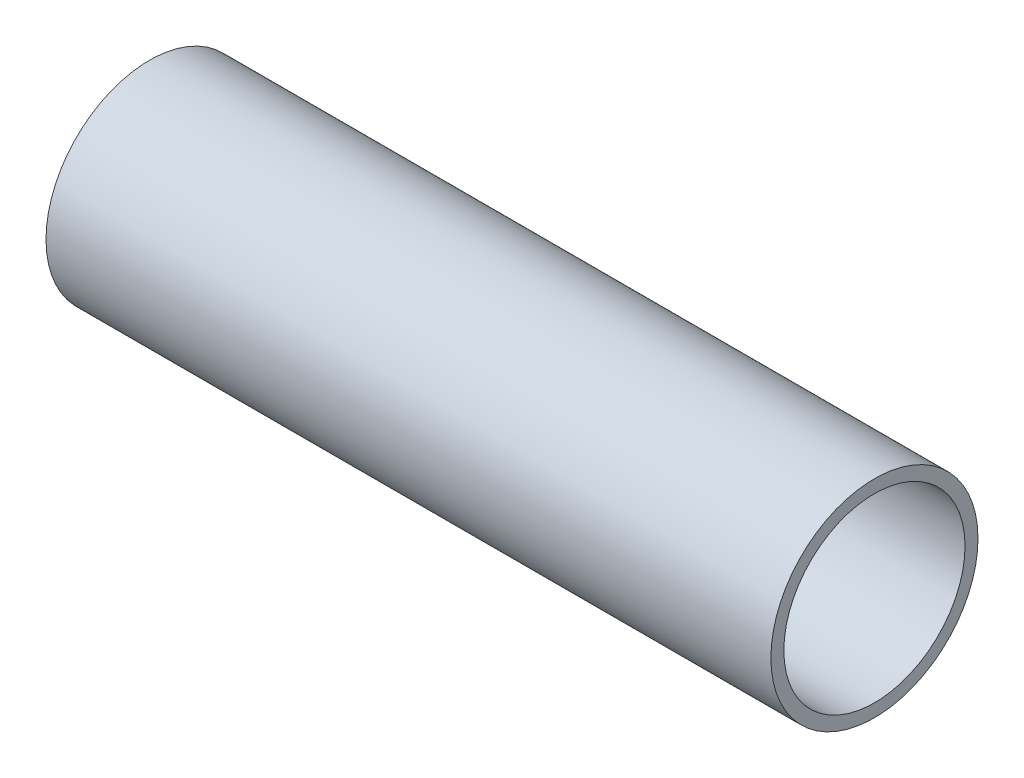
ISO-10303-21;
HEADER;
FILE_DESCRIPTION(('STEP AP214'),'2;1');
FILE_NAME('part.step','',(''),(''),'','','');
FILE_SCHEMA(('AUTOMOTIVE_DESIGN { 1 0 10303 214 1 1 1 1 }'));
ENDSEC;
DATA;
#1=APPLICATION_CONTEXT('core data for automotive mechanical design processes');
#2=APPLICATION_PROTOCOL_DEFINITION('international standard','automotive_design',2000,#1);
#3=PRODUCT_CONTEXT('',#1,'mechanical');
#4=PRODUCT('Part','Part','',(#3));
#5=PRODUCT_RELATED_PRODUCT_CATEGORY('part','',(#4));
#6=PRODUCT_DEFINITION_FORMATION('','',#4);
#7=PRODUCT_DEFINITION_CONTEXT('part definition',#1,'design');
#8=PRODUCT_DEFINITION('design','',#6,#7);
#9=PRODUCT_DEFINITION_SHAPE('','',#8);
#10=(LENGTH_UNIT() NAMED_UNIT(*) SI_UNIT(.MILLI.,.METRE.));
#11=(NAMED_UNIT(*) PLANE_ANGLE_UNIT() SI_UNIT($,.RADIAN.));
#12=(NAMED_UNIT(*) SI_UNIT($,.STERADIAN.) SOLID_ANGLE_UNIT());
#13=UNCERTAINTY_MEASURE_WITH_UNIT(LENGTH_MEASURE(1.E-05),#10,'distance_accuracy_value','');
#14=(GEOMETRIC_REPRESENTATION_CONTEXT(3) GLOBAL_UNCERTAINTY_ASSIGNED_CONTEXT((#13)) GLOBAL_UNIT_ASSIGNED_CONTEXT((#10,
#11,#12)) REPRESENTATION_CONTEXT('',''));
#15=CARTESIAN_POINT('',(0.,0.,0.));
#16=DIRECTION('',(0.,0.,1.));
#17=DIRECTION('',(1.,0.,0.));
#18=AXIS2_PLACEMENT_3D('',#15,#16,#17);
#19=CARTESIAN_POINT('',(177.8,0.,0.));
#20=DIRECTION('',(1.,0.,0.));
#21=DIRECTION('',(0.,0.,-1.));
#22=AXIS2_PLACEMENT_3D('',#19,#20,#21);
#23=PLANE('',#22);
#24=CARTESIAN_POINT('',(177.8,0.,0.));
#25=DIRECTION('',(1.,0.,0.));
#26=DIRECTION('',(0.,0.,-1.));
#27=AXIS2_PLACEMENT_3D('',#24,#25,#26);
#28=CIRCLE('',#27,25.4);
#29=CARTESIAN_POINT('',(177.8,0.,-25.4));
#30=VERTEX_POINT('',#29);
#31=EDGE_CURVE('E10',#30,#30,#28,.T.);
#32=ORIENTED_EDGE('',*,*,#31,.T.);
#33=EDGE_LOOP('',(#32));
#34=FACE_BOUND('',#33,.T.);
#35=CARTESIAN_POINT('',(177.8,0.,0.));
#36=DIRECTION('',(1.,0.,0.));
#37=DIRECTION('',(0.,0.,-1.));
#38=AXIS2_PLACEMENT_3D('',#35,#36,#37);
#39=CIRCLE('',#38,22.225);
#40=CARTESIAN_POINT('',(177.8,0.,-22.225));
#41=VERTEX_POINT('',#40);
#42=EDGE_CURVE('E45',#41,#41,#39,.T.);
#43=ORIENTED_EDGE('',*,*,#42,.F.);
#44=EDGE_LOOP('',(#43));
#45=FACE_BOUND('',#44,.T.);
#46=ADVANCED_FACE('F34',(#34,#45),#23,.T.);
#47=CARTESIAN_POINT('',(0.,0.,0.));
#48=DIRECTION('',(1.,0.,0.));
#49=DIRECTION('',(0.,0.,-1.));
#50=AXIS2_PLACEMENT_3D('',#47,#48,#49);
#51=PLANE('',#50);
#52=CARTESIAN_POINT('',(0.,0.,0.));
#53=DIRECTION('',(1.,0.,0.));
#54=DIRECTION('',(0.,0.,-1.));
#55=AXIS2_PLACEMENT_3D('',#52,#53,#54);
#56=CIRCLE('',#55,25.4);
#57=CARTESIAN_POINT('',(0.,0.,-25.4));
#58=VERTEX_POINT('',#57);
#59=EDGE_CURVE('E38',#58,#58,#56,.T.);
#60=ORIENTED_EDGE('',*,*,#59,.F.);
#61=EDGE_LOOP('',(#60));
#62=FACE_BOUND('',#61,.T.);
#63=CARTESIAN_POINT('',(0.,0.,0.));
#64=DIRECTION('',(1.,0.,0.));
#65=DIRECTION('',(0.,0.,-1.));
#66=AXIS2_PLACEMENT_3D('',#63,#64,#65);
#67=CIRCLE('',#66,22.225);
#68=CARTESIAN_POINT('',(0.,0.,-22.225));
#69=VERTEX_POINT('',#68);
#70=EDGE_CURVE('E47',#69,#69,#67,.T.);
#71=ORIENTED_EDGE('',*,*,#70,.T.);
#72=EDGE_LOOP('',(#71));
#73=FACE_BOUND('',#72,.T.);
#74=ADVANCED_FACE('F57',(#62,#73),#51,.F.);
#75=CARTESIAN_POINT('',(177.8,0.,0.));
#76=DIRECTION('',(-1.,0.,0.));
#77=DIRECTION('',(0.,0.,1.));
#78=AXIS2_PLACEMENT_3D('',#75,#76,#77);
#79=CYLINDRICAL_SURFACE('',#78,25.4);
#80=ORIENTED_EDGE('',*,*,#31,.F.);
#81=EDGE_LOOP('',(#80));
#82=FACE_BOUND('',#81,.T.);
#83=ORIENTED_EDGE('',*,*,#59,.T.);
#84=EDGE_LOOP('',(#83));
#85=FACE_BOUND('',#84,.T.);
#86=ADVANCED_FACE('F36',(#82,#85),#79,.T.);
#87=CARTESIAN_POINT('',(177.8,0.,0.));
#88=DIRECTION('',(-1.,0.,0.));
#89=DIRECTION('',(0.,0.,1.));
#90=AXIS2_PLACEMENT_3D('',#87,#88,#89);
#91=CYLINDRICAL_SURFACE('',#90,22.225);
#92=ORIENTED_EDGE('',*,*,#42,.T.);
#93=EDGE_LOOP('',(#92));
#94=FACE_BOUND('',#93,.T.);
#95=ORIENTED_EDGE('',*,*,#70,.F.);
#96=EDGE_LOOP('',(#95));
#97=FACE_BOUND('',#96,.T.);
#98=ADVANCED_FACE('F53',(#94,#97),#91,.F.);
#99=CLOSED_SHELL('',(#46,#74,#86,#98));
#100=MANIFOLD_SOLID_BREP('B2',#99);
#101=ADVANCED_BREP_SHAPE_REPRESENTATION('',(#18,#100),#14);
#102=SHAPE_DEFINITION_REPRESENTATION(#9,#101);
ENDSEC;
END-ISO-10303-21;
